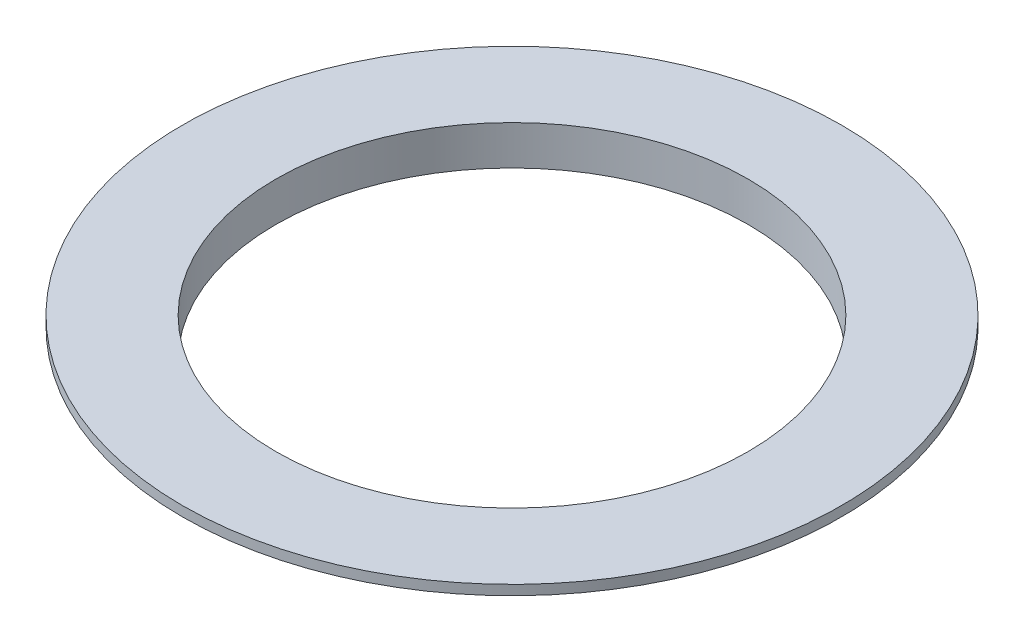
ISO-10303-21;
HEADER;
FILE_DESCRIPTION(('STEP AP214'),'2;1');
FILE_NAME('part.step','',(''),(''),'','','');
FILE_SCHEMA(('AUTOMOTIVE_DESIGN { 1 0 10303 214 1 1 1 1 }'));
ENDSEC;
DATA;
#1=APPLICATION_CONTEXT('core data for automotive mechanical design processes');
#2=APPLICATION_PROTOCOL_DEFINITION('international standard','automotive_design',2000,#1);
#3=PRODUCT_CONTEXT('',#1,'mechanical');
#4=PRODUCT('Part','Part','',(#3));
#5=PRODUCT_RELATED_PRODUCT_CATEGORY('part','',(#4));
#6=PRODUCT_DEFINITION_FORMATION('','',#4);
#7=PRODUCT_DEFINITION_CONTEXT('part definition',#1,'design');
#8=PRODUCT_DEFINITION('design','',#6,#7);
#9=PRODUCT_DEFINITION_SHAPE('','',#8);
#10=(LENGTH_UNIT() NAMED_UNIT(*) SI_UNIT(.MILLI.,.METRE.));
#11=(NAMED_UNIT(*) PLANE_ANGLE_UNIT() SI_UNIT($,.RADIAN.));
#12=(NAMED_UNIT(*) SI_UNIT($,.STERADIAN.) SOLID_ANGLE_UNIT());
#13=UNCERTAINTY_MEASURE_WITH_UNIT(LENGTH_MEASURE(1.E-05),#10,'distance_accuracy_value','');
#14=(GEOMETRIC_REPRESENTATION_CONTEXT(3) GLOBAL_UNCERTAINTY_ASSIGNED_CONTEXT((#13)) GLOBAL_UNIT_ASSIGNED_CONTEXT((#10,
#11,#12)) REPRESENTATION_CONTEXT('',''));
#15=CARTESIAN_POINT('',(0.,0.,0.));
#16=DIRECTION('',(0.,0.,1.));
#17=DIRECTION('',(1.,0.,0.));
#18=AXIS2_PLACEMENT_3D('',#15,#16,#17);
#19=CARTESIAN_POINT('',(0.,0.,0.));
#20=DIRECTION('',(0.,-1.,0.));
#21=DIRECTION('',(0.,0.,-1.));
#22=AXIS2_PLACEMENT_3D('',#19,#20,#21);
#23=CYLINDRICAL_SURFACE('',#22,80.9625);
#24=CARTESIAN_POINT('',(0.,9.525,0.));
#25=DIRECTION('',(0.,-1.,0.));
#26=DIRECTION('',(0.,0.,-1.));
#27=AXIS2_PLACEMENT_3D('',#24,#25,#26);
#28=CIRCLE('',#27,80.9625);
#29=CARTESIAN_POINT('',(0.,9.525,-80.9625));
#30=VERTEX_POINT('',#29);
#31=EDGE_CURVE('E47',#30,#30,#28,.T.);
#32=ORIENTED_EDGE('',*,*,#31,.T.);
#33=EDGE_LOOP('',(#32));
#34=FACE_BOUND('',#33,.T.);
#35=CARTESIAN_POINT('',(0.,0.,0.));
#36=DIRECTION('',(0.,-1.,0.));
#37=DIRECTION('',(0.,0.,-1.));
#38=AXIS2_PLACEMENT_3D('',#35,#36,#37);
#39=CIRCLE('',#38,80.9625);
#40=CARTESIAN_POINT('',(0.,0.,-80.9625));
#41=VERTEX_POINT('',#40);
#42=EDGE_CURVE('E10',#41,#41,#39,.T.);
#43=ORIENTED_EDGE('',*,*,#42,.F.);
#44=EDGE_LOOP('',(#43));
#45=FACE_BOUND('',#44,.T.);
#46=ADVANCED_FACE('F33',(#34,#45),#23,.T.);
#47=CARTESIAN_POINT('',(0.,0.,-50.8));
#48=DIRECTION('',(0.,-1.,0.));
#49=DIRECTION('',(0.,0.,-1.));
#50=AXIS2_PLACEMENT_3D('',#47,#48,#49);
#51=PLANE('',#50);
#52=CARTESIAN_POINT('',(0.,0.,0.));
#53=DIRECTION('',(0.,1.,0.));
#54=DIRECTION('',(0.,0.,1.));
#55=AXIS2_PLACEMENT_3D('',#52,#53,#54);
#56=CIRCLE('',#55,76.2);
#57=CARTESIAN_POINT('',(0.,0.,76.2));
#58=VERTEX_POINT('',#57);
#59=EDGE_CURVE('E52',#58,#58,#56,.T.);
#60=ORIENTED_EDGE('',*,*,#59,.T.);
#61=EDGE_LOOP('',(#60));
#62=FACE_BOUND('',#61,.T.);
#63=ORIENTED_EDGE('',*,*,#42,.T.);
#64=EDGE_LOOP('',(#63));
#65=FACE_BOUND('',#64,.T.);
#66=ADVANCED_FACE('F59',(#62,#65),#51,.T.);
#67=CARTESIAN_POINT('',(0.,12.7,-106.3625));
#68=DIRECTION('',(0.,1.,0.));
#69=DIRECTION('',(0.,0.,1.));
#70=AXIS2_PLACEMENT_3D('',#67,#68,#69);
#71=PLANE('',#70);
#72=CARTESIAN_POINT('',(0.,12.7,0.));
#73=DIRECTION('',(0.,1.,0.));
#74=DIRECTION('',(0.,0.,1.));
#75=AXIS2_PLACEMENT_3D('',#72,#73,#74);
#76=CIRCLE('',#75,76.2);
#77=CARTESIAN_POINT('',(0.,12.7,76.2));
#78=VERTEX_POINT('',#77);
#79=EDGE_CURVE('E53',#78,#78,#76,.T.);
#80=ORIENTED_EDGE('',*,*,#79,.F.);
#81=EDGE_LOOP('',(#80));
#82=FACE_BOUND('',#81,.T.);
#83=CARTESIAN_POINT('',(0.,12.7,0.));
#84=DIRECTION('',(0.,-1.,0.));
#85=DIRECTION('',(0.,0.,-1.));
#86=AXIS2_PLACEMENT_3D('',#83,#84,#85);
#87=CIRCLE('',#86,106.3625);
#88=CARTESIAN_POINT('',(0.,12.7,-106.3625));
#89=VERTEX_POINT('',#88);
#90=EDGE_CURVE('E39',#89,#89,#87,.T.);
#91=ORIENTED_EDGE('',*,*,#90,.F.);
#92=EDGE_LOOP('',(#91));
#93=FACE_BOUND('',#92,.T.);
#94=ADVANCED_FACE('F68',(#82,#93),#71,.T.);
#95=CARTESIAN_POINT('',(0.,0.,0.));
#96=DIRECTION('',(0.,-1.,0.));
#97=DIRECTION('',(0.,0.,-1.));
#98=AXIS2_PLACEMENT_3D('',#95,#96,#97);
#99=CYLINDRICAL_SURFACE('',#98,106.3625);
#100=ORIENTED_EDGE('',*,*,#90,.T.);
#101=EDGE_LOOP('',(#100));
#102=FACE_BOUND('',#101,.T.);
#103=CARTESIAN_POINT('',(0.,9.525,0.));
#104=DIRECTION('',(0.,-1.,0.));
#105=DIRECTION('',(0.,0.,-1.));
#106=AXIS2_PLACEMENT_3D('',#103,#104,#105);
#107=CIRCLE('',#106,106.3625);
#108=CARTESIAN_POINT('',(0.,9.525,-106.3625));
#109=VERTEX_POINT('',#108);
#110=EDGE_CURVE('E43',#109,#109,#107,.T.);
#111=ORIENTED_EDGE('',*,*,#110,.F.);
#112=EDGE_LOOP('',(#111));
#113=FACE_BOUND('',#112,.T.);
#114=ADVANCED_FACE('F71',(#102,#113),#99,.T.);
#115=CARTESIAN_POINT('',(0.,9.525,-80.9625));
#116=DIRECTION('',(0.,-1.,0.));
#117=DIRECTION('',(0.,0.,-1.));
#118=AXIS2_PLACEMENT_3D('',#115,#116,#117);
#119=PLANE('',#118);
#120=ORIENTED_EDGE('',*,*,#110,.T.);
#121=EDGE_LOOP('',(#120));
#122=FACE_BOUND('',#121,.T.);
#123=ORIENTED_EDGE('',*,*,#31,.F.);
#124=EDGE_LOOP('',(#123));
#125=FACE_BOUND('',#124,.T.);
#126=ADVANCED_FACE('F64',(#122,#125),#119,.T.);
#127=CARTESIAN_POINT('',(0.,0.,0.));
#128=DIRECTION('',(0.,1.,0.));
#129=DIRECTION('',(0.,0.,1.));
#130=AXIS2_PLACEMENT_3D('',#127,#128,#129);
#131=CYLINDRICAL_SURFACE('',#130,76.2);
#132=ORIENTED_EDGE('',*,*,#59,.F.);
#133=EDGE_LOOP('',(#132));
#134=FACE_BOUND('',#133,.T.);
#135=ORIENTED_EDGE('',*,*,#79,.T.);
#136=EDGE_LOOP('',(#135));
#137=FACE_BOUND('',#136,.T.);
#138=ADVANCED_FACE('F61',(#134,#137),#131,.F.);
#139=CLOSED_SHELL('',(#46,#66,#94,#114,#126,#138));
#140=MANIFOLD_SOLID_BREP('B2',#139);
#141=ADVANCED_BREP_SHAPE_REPRESENTATION('',(#18,#140),#14);
#142=SHAPE_DEFINITION_REPRESENTATION(#9,#141);
ENDSEC;
END-ISO-10303-21;
